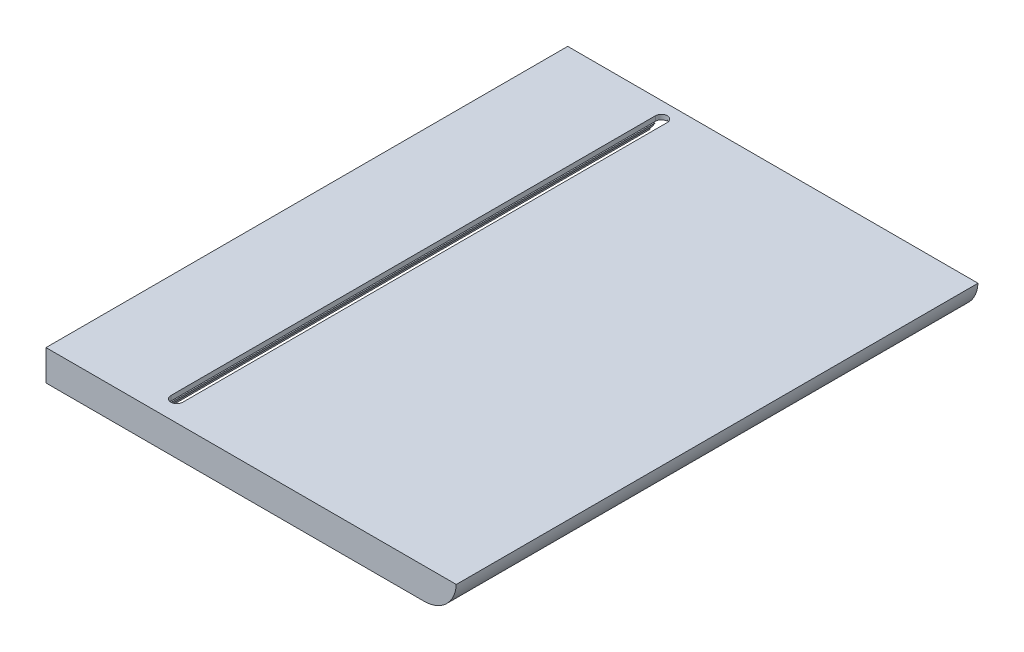
ISO-10303-21;
HEADER;
FILE_DESCRIPTION(('STEP AP214'),'2;1');
FILE_NAME('part.step','',(''),(''),'','','');
FILE_SCHEMA(('AUTOMOTIVE_DESIGN { 1 0 10303 214 1 1 1 1 }'));
ENDSEC;
DATA;
#1=APPLICATION_CONTEXT('core data for automotive mechanical design processes');
#2=APPLICATION_PROTOCOL_DEFINITION('international standard','automotive_design',2000,#1);
#3=PRODUCT_CONTEXT('',#1,'mechanical');
#4=PRODUCT('Part','Part','',(#3));
#5=PRODUCT_RELATED_PRODUCT_CATEGORY('part','',(#4));
#6=PRODUCT_DEFINITION_FORMATION('','',#4);
#7=PRODUCT_DEFINITION_CONTEXT('part definition',#1,'design');
#8=PRODUCT_DEFINITION('design','',#6,#7);
#9=PRODUCT_DEFINITION_SHAPE('','',#8);
#10=(LENGTH_UNIT() NAMED_UNIT(*) SI_UNIT(.MILLI.,.METRE.));
#11=(NAMED_UNIT(*) PLANE_ANGLE_UNIT() SI_UNIT($,.RADIAN.));
#12=(NAMED_UNIT(*) SI_UNIT($,.STERADIAN.) SOLID_ANGLE_UNIT());
#13=UNCERTAINTY_MEASURE_WITH_UNIT(LENGTH_MEASURE(1.E-05),#10,'distance_accuracy_value','');
#14=(GEOMETRIC_REPRESENTATION_CONTEXT(3) GLOBAL_UNCERTAINTY_ASSIGNED_CONTEXT((#13)) GLOBAL_UNIT_ASSIGNED_CONTEXT((#10,
#11,#12)) REPRESENTATION_CONTEXT('',''));
#15=CARTESIAN_POINT('',(0.,0.,0.));
#16=DIRECTION('',(0.,0.,1.));
#17=DIRECTION('',(1.,0.,0.));
#18=AXIS2_PLACEMENT_3D('',#15,#16,#17);
#19=CARTESIAN_POINT('',(66.7,-102.000000000001,100.67082039325));
#20=DIRECTION('',(-0.707106781186531,0.707106781186564,0.));
#21=DIRECTION('',(-0.707106781186564,-0.707106781186531,0.));
#22=AXIS2_PLACEMENT_3D('',#19,#20,#21);
#23=PLANE('',#22);
#24=DIRECTION('',(0.,0.,-1.));
#25=VECTOR('',#24,1.);
#26=CARTESIAN_POINT('',(67.,-101.700000000001,100.67082039325));
#27=LINE('',#26,#25);
#28=CARTESIAN_POINT('',(67.,-101.700000000001,-56.8249999999984));
#29=VERTEX_POINT('',#28);
#30=CARTESIAN_POINT('',(67.,-101.700000000001,-59.9999999999999));
#31=VERTEX_POINT('',#30);
#32=EDGE_CURVE('E382',#29,#31,#27,.T.);
#33=ORIENTED_EDGE('',*,*,#32,.F.);
#34=CARTESIAN_POINT('',(67.0000000000015,-101.699999999999,-55.));
#35=DIRECTION('',(-0.707106781186531,0.707106781186564,0.));
#36=DIRECTION('',(0.707106781186564,0.707106781186531,0.));
#37=AXIS2_PLACEMENT_3D('',#34,#35,#36);
#38=ELLIPSE('',#37,2.5809397513287,1.82499999999849);
#39=CARTESIAN_POINT('',(66.7,-102.000000000001,-56.8001736027376));
#40=VERTEX_POINT('',#39);
#41=EDGE_CURVE('E499',#29,#40,#38,.T.);
#42=ORIENTED_EDGE('',*,*,#41,.T.);
#43=DIRECTION('',(0.,0.,-1.));
#44=VECTOR('',#43,1.);
#45=CARTESIAN_POINT('',(66.7,-102.000000000001,100.67082039325));
#46=LINE('',#45,#44);
#47=CARTESIAN_POINT('',(66.7,-102.000000000001,-59.9999999999999));
#48=VERTEX_POINT('',#47);
#49=EDGE_CURVE('E391',#40,#48,#46,.T.);
#50=ORIENTED_EDGE('',*,*,#49,.T.);
#51=DIRECTION('',(0.707106781186564,0.707106781186531,0.));
#52=VECTOR('',#51,1.);
#53=CARTESIAN_POINT('',(84.3499999999989,-84.3500000000028,-60.));
#54=LINE('',#53,#52);
#55=EDGE_CURVE('E399',#48,#31,#54,.T.);
#56=ORIENTED_EDGE('',*,*,#55,.T.);
#57=EDGE_LOOP('',(#33,#42,#50,#56));
#58=FACE_BOUND('',#57,.T.);
#59=ADVANCED_FACE('F33',(#58),#23,.F.);
#60=CARTESIAN_POINT('',(67.,-101.700000000001,100.67082039325));
#61=DIRECTION('',(0.707106781186531,0.707106781186564,0.));
#62=DIRECTION('',(-0.707106781186564,0.707106781186531,0.));
#63=AXIS2_PLACEMENT_3D('',#60,#61,#62);
#64=PLANE('',#63);
#65=DIRECTION('',(0.,0.,-1.));
#66=VECTOR('',#65,1.);
#67=CARTESIAN_POINT('',(67.3,-102.000000000001,100.67082039325));
#68=LINE('',#67,#66);
#69=CARTESIAN_POINT('',(67.3,-102.000000000001,-56.8001736027381));
#70=VERTEX_POINT('',#69);
#71=CARTESIAN_POINT('',(67.2999999999991,-102.,-60.));
#72=VERTEX_POINT('',#71);
#73=EDGE_CURVE('E386',#70,#72,#68,.T.);
#74=ORIENTED_EDGE('',*,*,#73,.F.);
#75=CARTESIAN_POINT('',(67.0000000000015,-101.700000000002,-55.));
#76=DIRECTION('',(0.707106781186531,0.707106781186564,0.));
#77=DIRECTION('',(-0.707106781186564,0.707106781186531,0.));
#78=AXIS2_PLACEMENT_3D('',#75,#76,#77);
#79=ELLIPSE('',#78,2.58093975132872,1.82499999999849);
#80=EDGE_CURVE('E489',#70,#29,#79,.T.);
#81=ORIENTED_EDGE('',*,*,#80,.T.);
#82=ORIENTED_EDGE('',*,*,#32,.T.);
#83=DIRECTION('',(0.707106781186564,-0.707106781186531,0.));
#84=VECTOR('',#83,1.);
#85=CARTESIAN_POINT('',(-17.350000000002,-17.3500000000028,-60.));
#86=LINE('',#85,#84);
#87=EDGE_CURVE('E396',#31,#72,#86,.T.);
#88=ORIENTED_EDGE('',*,*,#87,.T.);
#89=EDGE_LOOP('',(#74,#81,#82,#88));
#90=FACE_BOUND('',#89,.T.);
#91=ADVANCED_FACE('F494',(#90),#64,.F.);
#92=CARTESIAN_POINT('',(34.5000000000001,-102.,80.));
#93=DIRECTION('',(0.,-1.,0.));
#94=DIRECTION('',(0.,0.,-1.));
#95=AXIS2_PLACEMENT_3D('',#92,#93,#94);
#96=PLANE('',#95);
#97=DIRECTION('',(0.,0.,-1.));
#98=VECTOR('',#97,1.);
#99=CARTESIAN_POINT('',(57.2500000000008,-102.,80.));
#100=LINE('',#99,#98);
#101=CARTESIAN_POINT('',(57.2500000000008,-102.,100.));
#102=VERTEX_POINT('',#101);
#103=CARTESIAN_POINT('',(57.2500000000008,-102.,-60.));
#104=VERTEX_POINT('',#103);
#105=EDGE_CURVE('E335',#102,#104,#100,.T.);
#106=ORIENTED_EDGE('',*,*,#105,.F.);
#107=DIRECTION('',(1.,0.,0.));
#108=VECTOR('',#107,1.);
#109=CARTESIAN_POINT('',(34.5000000000001,-102.,100.));
#110=LINE('',#109,#108);
#111=CARTESIAN_POINT('',(34.5000000000001,-102.,100.));
#112=VERTEX_POINT('',#111);
#113=EDGE_CURVE('E439',#112,#102,#110,.T.);
#114=ORIENTED_EDGE('',*,*,#113,.F.);
#115=DIRECTION('',(0.,0.,1.));
#116=VECTOR('',#115,1.);
#117=CARTESIAN_POINT('',(34.5000000000001,-102.,80.));
#118=LINE('',#117,#116);
#119=CARTESIAN_POINT('',(34.5000000000001,-102.,-60.));
#120=VERTEX_POINT('',#119);
#121=EDGE_CURVE('E447',#120,#112,#118,.T.);
#122=ORIENTED_EDGE('',*,*,#121,.F.);
#123=DIRECTION('',(1.,0.,0.));
#124=VECTOR('',#123,1.);
#125=CARTESIAN_POINT('',(34.5000000000001,-102.,-60.));
#126=LINE('',#125,#124);
#127=EDGE_CURVE('E423',#120,#104,#126,.T.);
#128=ORIENTED_EDGE('',*,*,#127,.T.);
#129=EDGE_LOOP('',(#106,#114,#122,#128));
#130=FACE_BOUND('',#129,.T.);
#131=ADVANCED_FACE('F604',(#130),#96,.T.);
#132=CARTESIAN_POINT('',(0.,0.,100.));
#133=DIRECTION('',(0.,0.,1.));
#134=DIRECTION('',(1.,0.,0.));
#135=AXIS2_PLACEMENT_3D('',#132,#133,#134);
#136=PLANE('',#135);
#137=ORIENTED_EDGE('',*,*,#113,.T.);
#138=DIRECTION('',(0.,-1.,0.));
#139=VECTOR('',#138,1.);
#140=CARTESIAN_POINT('',(57.2500000000009,-110.,100.));
#141=LINE('',#140,#139);
#142=CARTESIAN_POINT('',(57.2500000000009,-108.5,100.));
#143=VERTEX_POINT('',#142);
#144=EDGE_CURVE('E297',#102,#143,#141,.T.);
#145=ORIENTED_EDGE('',*,*,#144,.T.);
#146=DIRECTION('',(-1.,0.,0.));
#147=VECTOR('',#146,1.);
#148=CARTESIAN_POINT('',(150.012507822281,-108.5,100.));
#149=LINE('',#148,#147);
#150=CARTESIAN_POINT('',(34.5000000000001,-108.5,100.));
#151=VERTEX_POINT('',#150);
#152=EDGE_CURVE('E431',#143,#151,#149,.T.);
#153=ORIENTED_EDGE('',*,*,#152,.T.);
#154=DIRECTION('',(0.,1.,0.));
#155=VECTOR('',#154,1.);
#156=CARTESIAN_POINT('',(34.5000000000001,-108.5,100.));
#157=LINE('',#156,#155);
#158=EDGE_CURVE('E435',#151,#112,#157,.T.);
#159=ORIENTED_EDGE('',*,*,#158,.T.);
#160=EDGE_LOOP('',(#137,#145,#153,#159));
#161=FACE_BOUND('',#160,.T.);
#162=ADVANCED_FACE('F640',(#161),#136,.F.);
#163=DIRECTION('',(0.499999999999999,0.866025403784439,0.));
#164=VECTOR('',#163,1.);
#165=CARTESIAN_POINT('',(60.4330127018922,-106.800000000001,100.));
#166=LINE('',#165,#164);
#167=CARTESIAN_POINT('',(59.278312163513,-108.800000000001,100.));
#168=VERTEX_POINT('',#167);
#169=CARTESIAN_POINT('',(60.0000000000009,-107.55,100.));
#170=VERTEX_POINT('',#169);
#171=EDGE_CURVE('E350',#168,#170,#166,.T.);
#172=ORIENTED_EDGE('',*,*,#171,.T.);
#173=DIRECTION('',(-1.,0.,0.));
#174=VECTOR('',#173,1.);
#175=CARTESIAN_POINT('',(58.5000000000009,-107.55,100.));
#176=LINE('',#175,#174);
#177=CARTESIAN_POINT('',(58.5000000000009,-107.55,100.));
#178=VERTEX_POINT('',#177);
#179=EDGE_CURVE('E294',#170,#178,#176,.T.);
#180=ORIENTED_EDGE('',*,*,#179,.T.);
#181=DIRECTION('',(0.,1.,0.));
#182=VECTOR('',#181,1.);
#183=CARTESIAN_POINT('',(58.5000000000008,-102.,100.));
#184=LINE('',#183,#182);
#185=CARTESIAN_POINT('',(58.5000000000008,-102.,100.));
#186=VERTEX_POINT('',#185);
#187=EDGE_CURVE('E291',#178,#186,#184,.T.);
#188=ORIENTED_EDGE('',*,*,#187,.T.);
#189=CARTESIAN_POINT('',(66.7,-102.000000000001,100.));
#190=VERTEX_POINT('',#189);
#191=EDGE_CURVE('E443',#186,#190,#110,.T.);
#192=ORIENTED_EDGE('',*,*,#191,.T.);
#193=DIRECTION('',(0.707106781186564,0.707106781186531,0.));
#194=VECTOR('',#193,1.);
#195=CARTESIAN_POINT('',(66.7,-102.000000000001,100.));
#196=LINE('',#195,#194);
#197=CARTESIAN_POINT('',(67.,-101.700000000001,100.));
#198=VERTEX_POINT('',#197);
#199=EDGE_CURVE('E379',#190,#198,#196,.T.);
#200=ORIENTED_EDGE('',*,*,#199,.T.);
#201=DIRECTION('',(0.707106781186564,-0.707106781186531,0.));
#202=VECTOR('',#201,1.);
#203=CARTESIAN_POINT('',(67.,-101.700000000001,100.));
#204=LINE('',#203,#202);
#205=CARTESIAN_POINT('',(67.3,-102.000000000001,100.));
#206=VERTEX_POINT('',#205);
#207=EDGE_CURVE('E383',#198,#206,#204,.T.);
#208=ORIENTED_EDGE('',*,*,#207,.T.);
#209=CARTESIAN_POINT('',(75.5000000000009,-102.,100.));
#210=VERTEX_POINT('',#209);
#211=EDGE_CURVE('E444',#206,#210,#110,.T.);
#212=ORIENTED_EDGE('',*,*,#211,.T.);
#213=DIRECTION('',(0.,-1.,0.));
#214=VECTOR('',#213,1.);
#215=CARTESIAN_POINT('',(75.5000000000009,-107.549999999999,100.));
#216=LINE('',#215,#214);
#217=CARTESIAN_POINT('',(75.5000000000009,-107.549999999999,100.));
#218=VERTEX_POINT('',#217);
#219=EDGE_CURVE('E289',#210,#218,#216,.T.);
#220=ORIENTED_EDGE('',*,*,#219,.T.);
#221=DIRECTION('',(-1.,0.,0.));
#222=VECTOR('',#221,1.);
#223=CARTESIAN_POINT('',(74.0000000000009,-107.549999999999,100.));
#224=LINE('',#223,#222);
#225=CARTESIAN_POINT('',(74.0000000000009,-107.549999999999,100.));
#226=VERTEX_POINT('',#225);
#227=EDGE_CURVE('E285',#218,#226,#224,.T.);
#228=ORIENTED_EDGE('',*,*,#227,.T.);
#229=DIRECTION('',(0.5,-0.866025403784439,0.));
#230=VECTOR('',#229,1.);
#231=CARTESIAN_POINT('',(74.721687836487,-108.800000000001,100.));
#232=LINE('',#231,#230);
#233=CARTESIAN_POINT('',(74.721687836487,-108.800000000001,100.));
#234=VERTEX_POINT('',#233);
#235=EDGE_CURVE('E348',#226,#234,#232,.T.);
#236=ORIENTED_EDGE('',*,*,#235,.T.);
#237=DIRECTION('',(1.,0.,0.));
#238=VECTOR('',#237,1.);
#239=CARTESIAN_POINT('',(75.5,-108.800000000001,100.));
#240=LINE('',#239,#238);
#241=CARTESIAN_POINT('',(75.5,-108.800000000001,100.));
#242=VERTEX_POINT('',#241);
#243=EDGE_CURVE('E343',#234,#242,#240,.T.);
#244=ORIENTED_EDGE('',*,*,#243,.T.);
#245=DIRECTION('',(0.,-1.,0.));
#246=VECTOR('',#245,1.);
#247=CARTESIAN_POINT('',(75.5,-108.800000000001,100.));
#248=LINE('',#247,#246);
#249=CARTESIAN_POINT('',(75.5,-110.000000000001,100.));
#250=VERTEX_POINT('',#249);
#251=EDGE_CURVE('E339',#242,#250,#248,.T.);
#252=ORIENTED_EDGE('',*,*,#251,.T.);
#253=DIRECTION('',(-1.,0.,0.));
#254=VECTOR('',#253,1.);
#255=CARTESIAN_POINT('',(75.5,-110.000000000001,100.));
#256=LINE('',#255,#254);
#257=CARTESIAN_POINT('',(58.5,-110.000000000001,100.));
#258=VERTEX_POINT('',#257);
#259=EDGE_CURVE('E361',#250,#258,#256,.T.);
#260=ORIENTED_EDGE('',*,*,#259,.T.);
#261=DIRECTION('',(0.,1.,0.));
#262=VECTOR('',#261,1.);
#263=CARTESIAN_POINT('',(58.5,-108.800000000001,100.));
#264=LINE('',#263,#262);
#265=CARTESIAN_POINT('',(58.5,-108.800000000001,100.));
#266=VERTEX_POINT('',#265);
#267=EDGE_CURVE('E357',#258,#266,#264,.T.);
#268=ORIENTED_EDGE('',*,*,#267,.T.);
#269=DIRECTION('',(1.,0.,0.));
#270=VECTOR('',#269,1.);
#271=CARTESIAN_POINT('',(59.278312163513,-108.800000000001,100.));
#272=LINE('',#271,#270);
#273=EDGE_CURVE('E353',#266,#168,#272,.T.);
#274=ORIENTED_EDGE('',*,*,#273,.T.);
#275=EDGE_LOOP('',(#172,#180,#188,#192,#200,#208,#212,#220,#228,#236,#244,#252,#260,#268,#274));
#276=FACE_BOUND('',#275,.T.);
#277=ADVANCED_FACE('F532',(#276),#136,.F.);
#278=CARTESIAN_POINT('',(67.0000000000015,-102.,-55.));
#279=DIRECTION('',(0.,-1.,0.));
#280=DIRECTION('',(0.,0.,-1.));
#281=AXIS2_PLACEMENT_3D('',#278,#279,#280);
#282=CIRCLE('',#281,1.82499999999849);
#283=CARTESIAN_POINT('',(68.8249999999985,-102.,-55.));
#284=VERTEX_POINT('',#283);
#285=EDGE_CURVE('E279',#70,#284,#282,.T.);
#286=ORIENTED_EDGE('',*,*,#285,.F.);
#287=ORIENTED_EDGE('',*,*,#73,.T.);
#288=CARTESIAN_POINT('',(75.5000000000009,-102.,-60.));
#289=VERTEX_POINT('',#288);
#290=EDGE_CURVE('E428',#72,#289,#126,.T.);
#291=ORIENTED_EDGE('',*,*,#290,.T.);
#292=DIRECTION('',(0.,0.,-1.));
#293=VECTOR('',#292,1.);
#294=CARTESIAN_POINT('',(75.5000000000008,-101.999999999999,121.691011963485));
#295=LINE('',#294,#293);
#296=EDGE_CURVE('E326',#210,#289,#295,.T.);
#297=ORIENTED_EDGE('',*,*,#296,.F.);
#298=ORIENTED_EDGE('',*,*,#211,.F.);
#299=CARTESIAN_POINT('',(67.3,-102.000000000001,96.8001736027483));
#300=VERTEX_POINT('',#299);
#301=EDGE_CURVE('E388',#206,#300,#68,.T.);
#302=ORIENTED_EDGE('',*,*,#301,.T.);
#303=CARTESIAN_POINT('',(67.0000000000015,-102.,95.));
#304=DIRECTION('',(0.,-1.,0.));
#305=DIRECTION('',(0.,0.,-1.));
#306=AXIS2_PLACEMENT_3D('',#303,#304,#305);
#307=CIRCLE('',#306,1.82500000000843);
#308=CARTESIAN_POINT('',(68.82500000001,-102.,94.9999999999967));
#309=VERTEX_POINT('',#308);
#310=EDGE_CURVE('E56',#309,#300,#307,.T.);
#311=ORIENTED_EDGE('',*,*,#310,.F.);
#312=DIRECTION('',(1.32486614271938E-13,0.,1.));
#313=VECTOR('',#312,1.);
#314=CARTESIAN_POINT('',(68.8250000000164,-102.,79.9999999999955));
#315=LINE('',#314,#313);
#316=EDGE_CURVE('E274',#284,#309,#315,.T.);
#317=ORIENTED_EDGE('',*,*,#316,.F.);
#318=EDGE_LOOP('',(#286,#287,#291,#297,#298,#302,#311,#317));
#319=FACE_BOUND('',#318,.T.);
#320=ADVANCED_FACE('F540',(#319),#96,.T.);
#321=CARTESIAN_POINT('',(150.012507822281,-108.5,80.));
#322=DIRECTION('',(0.,1.,0.));
#323=DIRECTION('',(-1.,0.,0.));
#324=AXIS2_PLACEMENT_3D('',#321,#322,#323);
#325=PLANE('',#324);
#326=DIRECTION('',(0.,0.,1.));
#327=VECTOR('',#326,1.);
#328=CARTESIAN_POINT('',(57.2500000000009,-108.5,80.));
#329=LINE('',#328,#327);
#330=CARTESIAN_POINT('',(57.2500000000009,-108.5,-60.));
#331=VERTEX_POINT('',#330);
#332=EDGE_CURVE('E337',#331,#143,#329,.T.);
#333=ORIENTED_EDGE('',*,*,#332,.F.);
#334=DIRECTION('',(-1.,0.,0.));
#335=VECTOR('',#334,1.);
#336=CARTESIAN_POINT('',(150.012507822281,-108.5,-60.));
#337=LINE('',#336,#335);
#338=CARTESIAN_POINT('',(34.5000000000001,-108.5,-60.));
#339=VERTEX_POINT('',#338);
#340=EDGE_CURVE('E405',#331,#339,#337,.T.);
#341=ORIENTED_EDGE('',*,*,#340,.T.);
#342=DIRECTION('',(0.,0.,1.));
#343=VECTOR('',#342,1.);
#344=CARTESIAN_POINT('',(34.5000000000001,-108.5,80.));
#345=LINE('',#344,#343);
#346=EDGE_CURVE('E449',#339,#151,#345,.T.);
#347=ORIENTED_EDGE('',*,*,#346,.T.);
#348=ORIENTED_EDGE('',*,*,#152,.F.);
#349=EDGE_LOOP('',(#333,#341,#347,#348));
#350=FACE_BOUND('',#349,.T.);
#351=ADVANCED_FACE('F613',(#350),#325,.T.);
#352=CARTESIAN_POINT('',(67.0000000000015,-102.,-55.));
#353=DIRECTION('',(0.,-1.,0.));
#354=DIRECTION('',(0.,0.,-1.));
#355=AXIS2_PLACEMENT_3D('',#352,#353,#354);
#356=CIRCLE('',#355,1.82499999999849);
#357=CARTESIAN_POINT('',(65.1750000000015,-102.,-55.));
#358=VERTEX_POINT('',#357);
#359=EDGE_CURVE('E273',#358,#40,#356,.T.);
#360=ORIENTED_EDGE('',*,*,#359,.F.);
#361=DIRECTION('',(0.,0.,-1.));
#362=VECTOR('',#361,1.);
#363=CARTESIAN_POINT('',(65.1750000000015,-102.,80.));
#364=LINE('',#363,#362);
#365=CARTESIAN_POINT('',(65.1750000000015,-102.,95.));
#366=VERTEX_POINT('',#365);
#367=EDGE_CURVE('E266',#366,#358,#364,.T.);
#368=ORIENTED_EDGE('',*,*,#367,.F.);
#369=CARTESIAN_POINT('',(67.0000000000015,-102.,95.));
#370=DIRECTION('',(0.,-1.,0.));
#371=DIRECTION('',(0.,0.,-1.));
#372=AXIS2_PLACEMENT_3D('',#369,#370,#371);
#373=CIRCLE('',#372,1.82500000000843);
#374=CARTESIAN_POINT('',(66.7,-102.000000000001,96.8001736027478));
#375=VERTEX_POINT('',#374);
#376=EDGE_CURVE('E253',#375,#366,#373,.T.);
#377=ORIENTED_EDGE('',*,*,#376,.F.);
#378=EDGE_CURVE('E394',#190,#375,#46,.T.);
#379=ORIENTED_EDGE('',*,*,#378,.F.);
#380=ORIENTED_EDGE('',*,*,#191,.F.);
#381=DIRECTION('',(0.,0.,-1.));
#382=VECTOR('',#381,1.);
#383=CARTESIAN_POINT('',(58.5000000000008,-102.,121.691011963485));
#384=LINE('',#383,#382);
#385=CARTESIAN_POINT('',(58.5000000000008,-102.,-60.));
#386=VERTEX_POINT('',#385);
#387=EDGE_CURVE('E323',#186,#386,#384,.T.);
#388=ORIENTED_EDGE('',*,*,#387,.T.);
#389=EDGE_CURVE('E427',#386,#48,#126,.T.);
#390=ORIENTED_EDGE('',*,*,#389,.T.);
#391=ORIENTED_EDGE('',*,*,#49,.F.);
#392=EDGE_LOOP('',(#360,#368,#377,#379,#380,#388,#390,#391));
#393=FACE_BOUND('',#392,.T.);
#394=ADVANCED_FACE('F271',(#393),#96,.T.);
#395=CARTESIAN_POINT('',(160.,-100.5,101.5));
#396=DIRECTION('',(0.,1.,0.));
#397=DIRECTION('',(-1.,0.,0.));
#398=AXIS2_PLACEMENT_3D('',#395,#396,#397);
#399=PLANE('',#398);
#400=CARTESIAN_POINT('',(67.0000000000015,-100.5,-55.));
#401=DIRECTION('',(0.,1.,0.));
#402=DIRECTION('',(-1.,0.,0.));
#403=AXIS2_PLACEMENT_3D('',#400,#401,#402);
#404=CIRCLE('',#403,1.82499999999849);
#405=CARTESIAN_POINT('',(68.8249999999985,-100.5,-55.));
#406=VERTEX_POINT('',#405);
#407=CARTESIAN_POINT('',(65.1750000000015,-100.5,-55.));
#408=VERTEX_POINT('',#407);
#409=EDGE_CURVE('E275',#406,#408,#404,.T.);
#410=ORIENTED_EDGE('',*,*,#409,.F.);
#411=DIRECTION('',(-1.32486614271938E-13,0.,-1.));
#412=VECTOR('',#411,1.);
#413=CARTESIAN_POINT('',(68.8250000000192,-100.5,101.500000000012));
#414=LINE('',#413,#412);
#415=CARTESIAN_POINT('',(68.82500000001,-100.5,94.9999999999967));
#416=VERTEX_POINT('',#415);
#417=EDGE_CURVE('E11',#416,#406,#414,.T.);
#418=ORIENTED_EDGE('',*,*,#417,.F.);
#419=CARTESIAN_POINT('',(67.0000000000015,-100.5,95.));
#420=DIRECTION('',(0.,1.,0.));
#421=DIRECTION('',(-1.,0.,0.));
#422=AXIS2_PLACEMENT_3D('',#419,#420,#421);
#423=CIRCLE('',#422,1.82500000000843);
#424=CARTESIAN_POINT('',(65.1750000000015,-100.5,95.));
#425=VERTEX_POINT('',#424);
#426=EDGE_CURVE('E953',#425,#416,#423,.T.);
#427=ORIENTED_EDGE('',*,*,#426,.F.);
#428=DIRECTION('',(0.,0.,1.));
#429=VECTOR('',#428,1.);
#430=CARTESIAN_POINT('',(65.1750000000015,-100.5,101.5));
#431=LINE('',#430,#429);
#432=EDGE_CURVE('E41',#408,#425,#431,.T.);
#433=ORIENTED_EDGE('',*,*,#432,.F.);
#434=EDGE_LOOP('',(#410,#418,#427,#433));
#435=FACE_BOUND('',#434,.T.);
#436=DIRECTION('',(0.,0.,-1.));
#437=VECTOR('',#436,1.);
#438=CARTESIAN_POINT('',(160.,-100.5,101.5));
#439=LINE('',#438,#437);
#440=CARTESIAN_POINT('',(160.,-100.5,101.5));
#441=VERTEX_POINT('',#440);
#442=CARTESIAN_POINT('',(160.,-100.5,-60.));
#443=VERTEX_POINT('',#442);
#444=EDGE_CURVE('E464',#441,#443,#439,.T.);
#445=ORIENTED_EDGE('',*,*,#444,.T.);
#446=DIRECTION('',(1.,0.,0.));
#447=VECTOR('',#446,1.);
#448=CARTESIAN_POINT('',(33.0000000000001,-100.5,-60.));
#449=LINE('',#448,#447);
#450=CARTESIAN_POINT('',(33.0000000000001,-100.5,-60.));
#451=VERTEX_POINT('',#450);
#452=EDGE_CURVE('E411',#451,#443,#449,.T.);
#453=ORIENTED_EDGE('',*,*,#452,.F.);
#454=DIRECTION('',(0.,0.,-1.));
#455=VECTOR('',#454,1.);
#456=CARTESIAN_POINT('',(33.0000000000001,-100.5,101.5));
#457=LINE('',#456,#455);
#458=CARTESIAN_POINT('',(33.0000000000001,-100.5,101.5));
#459=VERTEX_POINT('',#458);
#460=EDGE_CURVE('E468',#459,#451,#457,.T.);
#461=ORIENTED_EDGE('',*,*,#460,.F.);
#462=DIRECTION('',(1.,0.,0.));
#463=VECTOR('',#462,1.);
#464=CARTESIAN_POINT('',(160.,-100.5,101.5));
#465=LINE('',#464,#463);
#466=EDGE_CURVE('E460',#459,#441,#465,.T.);
#467=ORIENTED_EDGE('',*,*,#466,.T.);
#468=EDGE_LOOP('',(#445,#453,#461,#467));
#469=FACE_BOUND('',#468,.T.);
#470=ADVANCED_FACE('F625',(#435,#469),#399,.T.);
#471=CARTESIAN_POINT('',(33.0000000000001,-110.,101.5));
#472=DIRECTION('',(-1.,0.,0.));
#473=DIRECTION('',(0.,-1.,0.));
#474=AXIS2_PLACEMENT_3D('',#471,#472,#473);
#475=PLANE('',#474);
#476=ORIENTED_EDGE('',*,*,#460,.T.);
#477=DIRECTION('',(0.,1.,0.));
#478=VECTOR('',#477,1.);
#479=CARTESIAN_POINT('',(33.0000000000001,-110.,-60.));
#480=LINE('',#479,#478);
#481=CARTESIAN_POINT('',(33.0000000000001,-110.,-60.));
#482=VERTEX_POINT('',#481);
#483=EDGE_CURVE('E413',#482,#451,#480,.T.);
#484=ORIENTED_EDGE('',*,*,#483,.F.);
#485=DIRECTION('',(0.,0.,-1.));
#486=VECTOR('',#485,1.);
#487=CARTESIAN_POINT('',(33.0000000000001,-110.,101.5));
#488=LINE('',#487,#486);
#489=CARTESIAN_POINT('',(33.0000000000001,-110.,101.5));
#490=VERTEX_POINT('',#489);
#491=EDGE_CURVE('E463',#490,#482,#488,.T.);
#492=ORIENTED_EDGE('',*,*,#491,.F.);
#493=DIRECTION('',(0.,1.,0.));
#494=VECTOR('',#493,1.);
#495=CARTESIAN_POINT('',(33.0000000000001,-110.,101.5));
#496=LINE('',#495,#494);
#497=EDGE_CURVE('E457',#490,#459,#496,.T.);
#498=ORIENTED_EDGE('',*,*,#497,.T.);
#499=EDGE_LOOP('',(#476,#484,#492,#498));
#500=FACE_BOUND('',#499,.T.);
#501=ADVANCED_FACE('F699',(#500),#475,.T.);
#502=CARTESIAN_POINT('',(160.,-110.,101.5));
#503=DIRECTION('',(0.,-1.,0.));
#504=DIRECTION('',(1.,0.,0.));
#505=AXIS2_PLACEMENT_3D('',#502,#503,#504);
#506=PLANE('',#505);
#507=ORIENTED_EDGE('',*,*,#491,.T.);
#508=DIRECTION('',(-1.,0.,0.));
#509=VECTOR('',#508,1.);
#510=CARTESIAN_POINT('',(150.012507822281,-110.,-60.));
#511=LINE('',#510,#509);
#512=CARTESIAN_POINT('',(58.5,-110.000000000001,-60.));
#513=VERTEX_POINT('',#512);
#514=EDGE_CURVE('E416',#513,#482,#511,.T.);
#515=ORIENTED_EDGE('',*,*,#514,.F.);
#516=DIRECTION('',(0.,0.,-1.));
#517=VECTOR('',#516,1.);
#518=CARTESIAN_POINT('',(58.5,-110.000000000001,117.298554852935));
#519=LINE('',#518,#517);
#520=EDGE_CURVE('E360',#258,#513,#519,.T.);
#521=ORIENTED_EDGE('',*,*,#520,.F.);
#522=ORIENTED_EDGE('',*,*,#259,.F.);
#523=DIRECTION('',(0.,0.,-1.));
#524=VECTOR('',#523,1.);
#525=CARTESIAN_POINT('',(75.5,-110.000000000001,117.298554852935));
#526=LINE('',#525,#524);
#527=CARTESIAN_POINT('',(75.5,-110.000000000001,-60.));
#528=VERTEX_POINT('',#527);
#529=EDGE_CURVE('E342',#250,#528,#526,.T.);
#530=ORIENTED_EDGE('',*,*,#529,.T.);
#531=CARTESIAN_POINT('',(150.012507822281,-110.,-60.));
#532=VERTEX_POINT('',#531);
#533=EDGE_CURVE('E417',#532,#528,#511,.T.);
#534=ORIENTED_EDGE('',*,*,#533,.F.);
#535=DIRECTION('',(0.,0.,-1.));
#536=VECTOR('',#535,1.);
#537=CARTESIAN_POINT('',(150.012507822281,-110.,101.5));
#538=LINE('',#537,#536);
#539=CARTESIAN_POINT('',(150.012507822281,-110.,101.5));
#540=VERTEX_POINT('',#539);
#541=EDGE_CURVE('E467',#532,#540,#538,.F.);
#542=ORIENTED_EDGE('',*,*,#541,.T.);
#543=DIRECTION('',(-1.,0.,0.));
#544=VECTOR('',#543,1.);
#545=CARTESIAN_POINT('',(160.,-110.,101.5));
#546=LINE('',#545,#544);
#547=EDGE_CURVE('E455',#540,#490,#546,.T.);
#548=ORIENTED_EDGE('',*,*,#547,.T.);
#549=EDGE_LOOP('',(#507,#515,#521,#522,#530,#534,#542,#548));
#550=FACE_BOUND('',#549,.T.);
#551=ADVANCED_FACE('F563',(#550),#506,.T.);
#552=CARTESIAN_POINT('',(0.,0.,101.5));
#553=DIRECTION('',(0.,0.,1.));
#554=DIRECTION('',(1.,0.,0.));
#555=AXIS2_PLACEMENT_3D('',#552,#553,#554);
#556=PLANE('',#555);
#557=ORIENTED_EDGE('',*,*,#547,.F.);
#558=CARTESIAN_POINT('',(150.012507822281,-100.,101.5));
#559=DIRECTION('',(0.,0.,1.));
#560=DIRECTION('',(1.,0.,0.));
#561=AXIS2_PLACEMENT_3D('',#558,#559,#560);
#562=CIRCLE('',#561,10.);
#563=EDGE_CURVE('E473',#540,#441,#562,.T.);
#564=ORIENTED_EDGE('',*,*,#563,.T.);
#565=ORIENTED_EDGE('',*,*,#466,.F.);
#566=ORIENTED_EDGE('',*,*,#497,.F.);
#567=EDGE_LOOP('',(#557,#564,#565,#566));
#568=FACE_BOUND('',#567,.T.);
#569=ADVANCED_FACE('F730',(#568),#556,.T.);
#570=CARTESIAN_POINT('',(150.012507822281,-100.,101.5));
#571=DIRECTION('',(0.,0.,1.));
#572=DIRECTION('',(1.,0.,0.));
#573=AXIS2_PLACEMENT_3D('',#570,#571,#572);
#574=CYLINDRICAL_SURFACE('',#573,10.);
#575=ORIENTED_EDGE('',*,*,#563,.F.);
#576=ORIENTED_EDGE('',*,*,#541,.F.);
#577=CARTESIAN_POINT('',(150.012507822281,-100.,-60.));
#578=DIRECTION('',(0.,0.,-1.));
#579=DIRECTION('',(-1.,0.,0.));
#580=AXIS2_PLACEMENT_3D('',#577,#578,#579);
#581=CIRCLE('',#580,10.);
#582=EDGE_CURVE('E419',#443,#532,#581,.T.);
#583=ORIENTED_EDGE('',*,*,#582,.F.);
#584=ORIENTED_EDGE('',*,*,#444,.F.);
#585=EDGE_LOOP('',(#575,#576,#583,#584));
#586=FACE_BOUND('',#585,.T.);
#587=ADVANCED_FACE('F35',(#586),#574,.T.);
#588=CARTESIAN_POINT('',(0.,0.,-60.));
#589=DIRECTION('',(0.,0.,-1.));
#590=DIRECTION('',(-1.,0.,0.));
#591=AXIS2_PLACEMENT_3D('',#588,#589,#590);
#592=PLANE('',#591);
#593=ORIENTED_EDGE('',*,*,#340,.F.);
#594=DIRECTION('',(0.,1.,0.));
#595=VECTOR('',#594,1.);
#596=CARTESIAN_POINT('',(57.2500000000009,-110.,-60.));
#597=LINE('',#596,#595);
#598=EDGE_CURVE('E277',#331,#104,#597,.T.);
#599=ORIENTED_EDGE('',*,*,#598,.T.);
#600=ORIENTED_EDGE('',*,*,#127,.F.);
#601=DIRECTION('',(0.,1.,0.));
#602=VECTOR('',#601,1.);
#603=CARTESIAN_POINT('',(34.5000000000001,-108.5,-60.));
#604=LINE('',#603,#602);
#605=EDGE_CURVE('E402',#339,#120,#604,.T.);
#606=ORIENTED_EDGE('',*,*,#605,.F.);
#607=EDGE_LOOP('',(#593,#599,#600,#606));
#608=FACE_BOUND('',#607,.T.);
#609=CARTESIAN_POINT('',(76.7500000000009,-102.,-60.));
#610=VERTEX_POINT('',#609);
#611=CARTESIAN_POINT('',(158.27386364321,-102.,-60.));
#612=VERTEX_POINT('',#611);
#613=EDGE_CURVE('E422',#610,#612,#126,.T.);
#614=ORIENTED_EDGE('',*,*,#613,.F.);
#615=DIRECTION('',(0.,-1.,0.));
#616=VECTOR('',#615,1.);
#617=CARTESIAN_POINT('',(76.7500000000008,-100.499999999999,-60.));
#618=LINE('',#617,#616);
#619=CARTESIAN_POINT('',(76.7500000000009,-108.5,-60.));
#620=VERTEX_POINT('',#619);
#621=EDGE_CURVE('E303',#610,#620,#618,.T.);
#622=ORIENTED_EDGE('',*,*,#621,.T.);
#623=CARTESIAN_POINT('',(150.012507822281,-108.5,-60.));
#624=VERTEX_POINT('',#623);
#625=EDGE_CURVE('E406',#624,#620,#337,.T.);
#626=ORIENTED_EDGE('',*,*,#625,.F.);
#627=CARTESIAN_POINT('',(150.012507822281,-100.,-60.));
#628=DIRECTION('',(0.,0.,-1.));
#629=DIRECTION('',(-1.,0.,0.));
#630=AXIS2_PLACEMENT_3D('',#627,#628,#629);
#631=CIRCLE('',#630,8.5);
#632=EDGE_CURVE('E408',#612,#624,#631,.T.);
#633=ORIENTED_EDGE('',*,*,#632,.F.);
#634=EDGE_LOOP('',(#614,#622,#626,#633));
#635=FACE_BOUND('',#634,.T.);
#636=ORIENTED_EDGE('',*,*,#452,.T.);
#637=ORIENTED_EDGE('',*,*,#582,.T.);
#638=ORIENTED_EDGE('',*,*,#533,.T.);
#639=DIRECTION('',(0.,-1.,0.));
#640=VECTOR('',#639,1.);
#641=CARTESIAN_POINT('',(75.5,0.,-60.));
#642=LINE('',#641,#640);
#643=CARTESIAN_POINT('',(75.5,-108.800000000001,-60.));
#644=VERTEX_POINT('',#643);
#645=EDGE_CURVE('E477',#644,#528,#642,.T.);
#646=ORIENTED_EDGE('',*,*,#645,.F.);
#647=DIRECTION('',(1.,0.,0.));
#648=VECTOR('',#647,1.);
#649=CARTESIAN_POINT('',(0.,-108.800000000001,-60.));
#650=LINE('',#649,#648);
#651=CARTESIAN_POINT('',(74.721687836487,-108.800000000001,-60.));
#652=VERTEX_POINT('',#651);
#653=EDGE_CURVE('E475',#652,#644,#650,.T.);
#654=ORIENTED_EDGE('',*,*,#653,.F.);
#655=DIRECTION('',(0.5,-0.866025403784439,0.));
#656=VECTOR('',#655,1.);
#657=CARTESIAN_POINT('',(8.92948391149144,5.15543994002401,-60.));
#658=LINE('',#657,#656);
#659=CARTESIAN_POINT('',(74.0000000000009,-107.549999999999,-60.));
#660=VERTEX_POINT('',#659);
#661=EDGE_CURVE('E375',#660,#652,#658,.T.);
#662=ORIENTED_EDGE('',*,*,#661,.F.);
#663=DIRECTION('',(1.,0.,0.));
#664=VECTOR('',#663,1.);
#665=CARTESIAN_POINT('',(74.0000000000009,-107.549999999999,-60.));
#666=LINE('',#665,#664);
#667=CARTESIAN_POINT('',(75.5000000000009,-107.549999999999,-60.));
#668=VERTEX_POINT('',#667);
#669=EDGE_CURVE('E306',#660,#668,#666,.T.);
#670=ORIENTED_EDGE('',*,*,#669,.T.);
#671=DIRECTION('',(0.,1.,0.));
#672=VECTOR('',#671,1.);
#673=CARTESIAN_POINT('',(75.5000000000009,-107.549999999999,-60.));
#674=LINE('',#673,#672);
#675=EDGE_CURVE('E309',#668,#289,#674,.T.);
#676=ORIENTED_EDGE('',*,*,#675,.T.);
#677=ORIENTED_EDGE('',*,*,#290,.F.);
#678=ORIENTED_EDGE('',*,*,#87,.F.);
#679=ORIENTED_EDGE('',*,*,#55,.F.);
#680=ORIENTED_EDGE('',*,*,#389,.F.);
#681=DIRECTION('',(0.,-1.,0.));
#682=VECTOR('',#681,1.);
#683=CARTESIAN_POINT('',(58.5000000000008,-102.,-60.));
#684=LINE('',#683,#682);
#685=CARTESIAN_POINT('',(58.5000000000009,-107.55,-60.));
#686=VERTEX_POINT('',#685);
#687=EDGE_CURVE('E312',#386,#686,#684,.T.);
#688=ORIENTED_EDGE('',*,*,#687,.T.);
#689=DIRECTION('',(1.,0.,0.));
#690=VECTOR('',#689,1.);
#691=CARTESIAN_POINT('',(58.5000000000009,-107.55,-60.));
#692=LINE('',#691,#690);
#693=CARTESIAN_POINT('',(60.0000000000009,-107.55,-60.));
#694=VERTEX_POINT('',#693);
#695=EDGE_CURVE('E315',#686,#694,#692,.T.);
#696=ORIENTED_EDGE('',*,*,#695,.T.);
#697=DIRECTION('',(0.499999999999999,0.866025403784439,0.));
#698=VECTOR('',#697,1.);
#699=CARTESIAN_POINT('',(91.5705160885086,-52.8682621135333,-60.));
#700=LINE('',#699,#698);
#701=CARTESIAN_POINT('',(59.278312163513,-108.800000000001,-60.));
#702=VERTEX_POINT('',#701);
#703=EDGE_CURVE('E377',#702,#694,#700,.T.);
#704=ORIENTED_EDGE('',*,*,#703,.F.);
#705=DIRECTION('',(1.,0.,0.));
#706=VECTOR('',#705,1.);
#707=CARTESIAN_POINT('',(-3.87994273833557E-12,-108.799999999999,-60.));
#708=LINE('',#707,#706);
#709=CARTESIAN_POINT('',(58.5,-108.800000000001,-60.));
#710=VERTEX_POINT('',#709);
#711=EDGE_CURVE('E480',#710,#702,#708,.T.);
#712=ORIENTED_EDGE('',*,*,#711,.F.);
#713=DIRECTION('',(0.,1.,0.));
#714=VECTOR('',#713,1.);
#715=CARTESIAN_POINT('',(58.5,0.,-60.));
#716=LINE('',#715,#714);
#717=EDGE_CURVE('E482',#513,#710,#716,.T.);
#718=ORIENTED_EDGE('',*,*,#717,.F.);
#719=ORIENTED_EDGE('',*,*,#514,.T.);
#720=ORIENTED_EDGE('',*,*,#483,.T.);
#721=EDGE_LOOP('',(#636,#637,#638,#646,#654,#662,#670,#676,#677,#678,#679,#680,#688,#696,#704,
#712,#718,#719,#720));
#722=FACE_BOUND('',#721,.T.);
#723=ADVANCED_FACE('F506',(#608,#635,#722),#592,.T.);
#724=CARTESIAN_POINT('',(150.012507822281,-108.5,100.));
#725=VERTEX_POINT('',#724);
#726=CARTESIAN_POINT('',(76.7500000000009,-108.5,100.));
#727=VERTEX_POINT('',#726);
#728=EDGE_CURVE('E432',#725,#727,#149,.T.);
#729=ORIENTED_EDGE('',*,*,#728,.T.);
#730=DIRECTION('',(0.,1.,0.));
#731=VECTOR('',#730,1.);
#732=CARTESIAN_POINT('',(76.7500000000008,-100.499999999999,100.));
#733=LINE('',#732,#731);
#734=CARTESIAN_POINT('',(76.7500000000009,-102.,100.));
#735=VERTEX_POINT('',#734);
#736=EDGE_CURVE('E283',#727,#735,#733,.T.);
#737=ORIENTED_EDGE('',*,*,#736,.T.);
#738=CARTESIAN_POINT('',(158.27386364321,-102.,100.));
#739=VERTEX_POINT('',#738);
#740=EDGE_CURVE('E438',#735,#739,#110,.T.);
#741=ORIENTED_EDGE('',*,*,#740,.T.);
#742=CARTESIAN_POINT('',(150.012507822281,-100.,100.));
#743=DIRECTION('',(0.,0.,-1.));
#744=DIRECTION('',(-1.,0.,0.));
#745=AXIS2_PLACEMENT_3D('',#742,#743,#744);
#746=CIRCLE('',#745,8.5);
#747=EDGE_CURVE('E426',#739,#725,#746,.T.);
#748=ORIENTED_EDGE('',*,*,#747,.T.);
#749=EDGE_LOOP('',(#729,#737,#741,#748));
#750=FACE_BOUND('',#749,.T.);
#751=ADVANCED_FACE('F527',(#750),#136,.F.);
#752=CARTESIAN_POINT('',(34.5000000000001,-108.5,80.));
#753=DIRECTION('',(1.,0.,0.));
#754=DIRECTION('',(0.,1.,0.));
#755=AXIS2_PLACEMENT_3D('',#752,#753,#754);
#756=PLANE('',#755);
#757=ORIENTED_EDGE('',*,*,#158,.F.);
#758=ORIENTED_EDGE('',*,*,#346,.F.);
#759=ORIENTED_EDGE('',*,*,#605,.T.);
#760=ORIENTED_EDGE('',*,*,#121,.T.);
#761=EDGE_LOOP('',(#757,#758,#759,#760));
#762=FACE_BOUND('',#761,.T.);
#763=ADVANCED_FACE('F637',(#762),#756,.T.);
#764=DIRECTION('',(0.,0.,1.));
#765=VECTOR('',#764,1.);
#766=CARTESIAN_POINT('',(76.7500000000008,-102.,80.));
#767=LINE('',#766,#765);
#768=EDGE_CURVE('E300',#610,#735,#767,.T.);
#769=ORIENTED_EDGE('',*,*,#768,.F.);
#770=ORIENTED_EDGE('',*,*,#613,.T.);
#771=DIRECTION('',(0.,0.,1.));
#772=VECTOR('',#771,1.);
#773=CARTESIAN_POINT('',(158.27386364321,-102.,80.));
#774=LINE('',#773,#772);
#775=EDGE_CURVE('E442',#612,#739,#774,.T.);
#776=ORIENTED_EDGE('',*,*,#775,.T.);
#777=ORIENTED_EDGE('',*,*,#740,.F.);
#778=EDGE_LOOP('',(#769,#770,#776,#777));
#779=FACE_BOUND('',#778,.T.);
#780=ADVANCED_FACE('F512',(#779),#96,.T.);
#781=CARTESIAN_POINT('',(150.012507822281,-100.,80.));
#782=DIRECTION('',(0.,0.,1.));
#783=DIRECTION('',(1.,0.,0.));
#784=AXIS2_PLACEMENT_3D('',#781,#782,#783);
#785=CYLINDRICAL_SURFACE('',#784,8.5);
#786=ORIENTED_EDGE('',*,*,#747,.F.);
#787=ORIENTED_EDGE('',*,*,#775,.F.);
#788=ORIENTED_EDGE('',*,*,#632,.T.);
#789=DIRECTION('',(0.,0.,1.));
#790=VECTOR('',#789,1.);
#791=CARTESIAN_POINT('',(150.012507822281,-108.5,80.));
#792=LINE('',#791,#790);
#793=EDGE_CURVE('E452',#624,#725,#792,.T.);
#794=ORIENTED_EDGE('',*,*,#793,.T.);
#795=EDGE_LOOP('',(#786,#787,#788,#794));
#796=FACE_BOUND('',#795,.T.);
#797=ADVANCED_FACE('F519',(#796),#785,.F.);
#798=DIRECTION('',(0.,0.,-1.));
#799=VECTOR('',#798,1.);
#800=CARTESIAN_POINT('',(76.7500000000009,-108.5,80.));
#801=LINE('',#800,#799);
#802=EDGE_CURVE('E484',#727,#620,#801,.T.);
#803=ORIENTED_EDGE('',*,*,#802,.F.);
#804=ORIENTED_EDGE('',*,*,#728,.F.);
#805=ORIENTED_EDGE('',*,*,#793,.F.);
#806=ORIENTED_EDGE('',*,*,#625,.T.);
#807=EDGE_LOOP('',(#803,#804,#805,#806));
#808=FACE_BOUND('',#807,.T.);
#809=ADVANCED_FACE('F522',(#808),#325,.T.);
#810=ORIENTED_EDGE('',*,*,#378,.T.);
#811=CARTESIAN_POINT('',(67.0000000000015,-101.699999999999,95.));
#812=DIRECTION('',(-0.707106781186531,0.707106781186564,0.));
#813=DIRECTION('',(0.707106781186564,0.707106781186531,0.));
#814=AXIS2_PLACEMENT_3D('',#811,#812,#813);
#815=ELLIPSE('',#814,2.58093975134275,1.82500000000843);
#816=CARTESIAN_POINT('',(67.,-101.700000000001,96.8250000000084));
#817=VERTEX_POINT('',#816);
#818=EDGE_CURVE('E259',#375,#817,#815,.T.);
#819=ORIENTED_EDGE('',*,*,#818,.T.);
#820=EDGE_CURVE('E387',#198,#817,#27,.T.);
#821=ORIENTED_EDGE('',*,*,#820,.F.);
#822=ORIENTED_EDGE('',*,*,#199,.F.);
#823=EDGE_LOOP('',(#810,#819,#821,#822));
#824=FACE_BOUND('',#823,.T.);
#825=ADVANCED_FACE('F535',(#824),#23,.F.);
#826=ORIENTED_EDGE('',*,*,#820,.T.);
#827=CARTESIAN_POINT('',(67.0000000000015,-101.700000000002,95.));
#828=DIRECTION('',(0.707106781186531,0.707106781186564,0.));
#829=DIRECTION('',(-0.707106781186564,0.707106781186531,0.));
#830=AXIS2_PLACEMENT_3D('',#827,#828,#829);
#831=ELLIPSE('',#830,2.58093975134277,1.82500000000843);
#832=EDGE_CURVE('E487',#817,#300,#831,.T.);
#833=ORIENTED_EDGE('',*,*,#832,.T.);
#834=ORIENTED_EDGE('',*,*,#301,.F.);
#835=ORIENTED_EDGE('',*,*,#207,.F.);
#836=EDGE_LOOP('',(#826,#833,#834,#835));
#837=FACE_BOUND('',#836,.T.);
#838=ADVANCED_FACE('F537',(#837),#64,.F.);
#839=CARTESIAN_POINT('',(75.5,-108.800000000001,117.298554852935));
#840=DIRECTION('',(1.,0.,0.));
#841=DIRECTION('',(0.,0.,-1.));
#842=AXIS2_PLACEMENT_3D('',#839,#840,#841);
#843=PLANE('',#842);
#844=ORIENTED_EDGE('',*,*,#645,.T.);
#845=ORIENTED_EDGE('',*,*,#529,.F.);
#846=ORIENTED_EDGE('',*,*,#251,.F.);
#847=DIRECTION('',(0.,0.,-1.));
#848=VECTOR('',#847,1.);
#849=CARTESIAN_POINT('',(75.5,-108.800000000001,117.298554852935));
#850=LINE('',#849,#848);
#851=EDGE_CURVE('E346',#242,#644,#850,.T.);
#852=ORIENTED_EDGE('',*,*,#851,.T.);
#853=EDGE_LOOP('',(#844,#845,#846,#852));
#854=FACE_BOUND('',#853,.T.);
#855=ADVANCED_FACE('F559',(#854),#843,.F.);
#856=CARTESIAN_POINT('',(58.5,-108.800000000001,117.298554852935));
#857=DIRECTION('',(-1.,0.,0.));
#858=DIRECTION('',(0.,0.,1.));
#859=AXIS2_PLACEMENT_3D('',#856,#857,#858);
#860=PLANE('',#859);
#861=ORIENTED_EDGE('',*,*,#717,.T.);
#862=DIRECTION('',(0.,0.,-1.));
#863=VECTOR('',#862,1.);
#864=CARTESIAN_POINT('',(58.5,-108.800000000001,117.298554852935));
#865=LINE('',#864,#863);
#866=EDGE_CURVE('E356',#266,#710,#865,.T.);
#867=ORIENTED_EDGE('',*,*,#866,.F.);
#868=ORIENTED_EDGE('',*,*,#267,.F.);
#869=ORIENTED_EDGE('',*,*,#520,.T.);
#870=EDGE_LOOP('',(#861,#867,#868,#869));
#871=FACE_BOUND('',#870,.T.);
#872=ADVANCED_FACE('F570',(#871),#860,.F.);
#873=CARTESIAN_POINT('',(59.278312163513,-108.800000000001,117.298554852935));
#874=DIRECTION('',(0.,1.,0.));
#875=DIRECTION('',(-1.,0.,0.));
#876=AXIS2_PLACEMENT_3D('',#873,#874,#875);
#877=PLANE('',#876);
#878=ORIENTED_EDGE('',*,*,#711,.T.);
#879=DIRECTION('',(0.,0.,-1.));
#880=VECTOR('',#879,1.);
#881=CARTESIAN_POINT('',(59.278312163513,-108.800000000001,117.298554852935));
#882=LINE('',#881,#880);
#883=EDGE_CURVE('E352',#168,#702,#882,.T.);
#884=ORIENTED_EDGE('',*,*,#883,.F.);
#885=ORIENTED_EDGE('',*,*,#273,.F.);
#886=ORIENTED_EDGE('',*,*,#866,.T.);
#887=EDGE_LOOP('',(#878,#884,#885,#886));
#888=FACE_BOUND('',#887,.T.);
#889=ADVANCED_FACE('F576',(#888),#877,.F.);
#890=CARTESIAN_POINT('',(60.4330127018922,-106.800000000001,117.298554852935));
#891=DIRECTION('',(-0.866025403784439,0.499999999999999,0.));
#892=DIRECTION('',(-0.499999999999999,-0.866025403784439,0.));
#893=AXIS2_PLACEMENT_3D('',#890,#891,#892);
#894=PLANE('',#893);
#895=ORIENTED_EDGE('',*,*,#703,.T.);
#896=DIRECTION('',(0.,0.,-1.));
#897=VECTOR('',#896,1.);
#898=CARTESIAN_POINT('',(60.0000000000009,-107.55,121.691011963485));
#899=LINE('',#898,#897);
#900=EDGE_CURVE('E286',#170,#694,#899,.T.);
#901=ORIENTED_EDGE('',*,*,#900,.F.);
#902=ORIENTED_EDGE('',*,*,#171,.F.);
#903=ORIENTED_EDGE('',*,*,#883,.T.);
#904=EDGE_LOOP('',(#895,#901,#902,#903));
#905=FACE_BOUND('',#904,.T.);
#906=ADVANCED_FACE('F578',(#905),#894,.F.);
#907=CARTESIAN_POINT('',(74.721687836487,-108.800000000001,117.298554852935));
#908=DIRECTION('',(0.866025403784439,0.5,0.));
#909=DIRECTION('',(-0.5,0.866025403784439,0.));
#910=AXIS2_PLACEMENT_3D('',#907,#908,#909);
#911=PLANE('',#910);
#912=ORIENTED_EDGE('',*,*,#661,.T.);
#913=DIRECTION('',(0.,0.,-1.));
#914=VECTOR('',#913,1.);
#915=CARTESIAN_POINT('',(74.721687836487,-108.800000000001,117.298554852935));
#916=LINE('',#915,#914);
#917=EDGE_CURVE('E347',#234,#652,#916,.T.);
#918=ORIENTED_EDGE('',*,*,#917,.F.);
#919=ORIENTED_EDGE('',*,*,#235,.F.);
#920=DIRECTION('',(0.,0.,-1.));
#921=VECTOR('',#920,1.);
#922=CARTESIAN_POINT('',(74.0000000000009,-107.549999999999,121.691011963485));
#923=LINE('',#922,#921);
#924=EDGE_CURVE('E318',#226,#660,#923,.T.);
#925=ORIENTED_EDGE('',*,*,#924,.T.);
#926=EDGE_LOOP('',(#912,#918,#919,#925));
#927=FACE_BOUND('',#926,.T.);
#928=ADVANCED_FACE('F550',(#927),#911,.F.);
#929=CARTESIAN_POINT('',(75.5,-108.800000000001,117.298554852935));
#930=DIRECTION('',(0.,1.,0.));
#931=DIRECTION('',(0.,0.,1.));
#932=AXIS2_PLACEMENT_3D('',#929,#930,#931);
#933=PLANE('',#932);
#934=ORIENTED_EDGE('',*,*,#653,.T.);
#935=ORIENTED_EDGE('',*,*,#851,.F.);
#936=ORIENTED_EDGE('',*,*,#243,.F.);
#937=ORIENTED_EDGE('',*,*,#917,.T.);
#938=EDGE_LOOP('',(#934,#935,#936,#937));
#939=FACE_BOUND('',#938,.T.);
#940=ADVANCED_FACE('F555',(#939),#933,.F.);
#941=CARTESIAN_POINT('',(76.7500000000008,-100.499999999999,121.691011963485));
#942=DIRECTION('',(1.,0.,0.));
#943=DIRECTION('',(0.,1.,0.));
#944=AXIS2_PLACEMENT_3D('',#941,#942,#943);
#945=PLANE('',#944);
#946=ORIENTED_EDGE('',*,*,#621,.F.);
#947=ORIENTED_EDGE('',*,*,#768,.T.);
#948=ORIENTED_EDGE('',*,*,#736,.F.);
#949=ORIENTED_EDGE('',*,*,#802,.T.);
#950=EDGE_LOOP('',(#946,#947,#948,#949));
#951=FACE_BOUND('',#950,.T.);
#952=ADVANCED_FACE('F525',(#951),#945,.T.);
#953=CARTESIAN_POINT('',(75.5000000000009,-107.549999999999,121.691011963485));
#954=DIRECTION('',(-1.,0.,0.));
#955=DIRECTION('',(0.,-1.,0.));
#956=AXIS2_PLACEMENT_3D('',#953,#954,#955);
#957=PLANE('',#956);
#958=ORIENTED_EDGE('',*,*,#219,.F.);
#959=ORIENTED_EDGE('',*,*,#296,.T.);
#960=ORIENTED_EDGE('',*,*,#675,.F.);
#961=DIRECTION('',(0.,0.,-1.));
#962=VECTOR('',#961,1.);
#963=CARTESIAN_POINT('',(75.5000000000009,-107.549999999999,121.691011963485));
#964=LINE('',#963,#962);
#965=EDGE_CURVE('E329',#218,#668,#964,.T.);
#966=ORIENTED_EDGE('',*,*,#965,.F.);
#967=EDGE_LOOP('',(#958,#959,#960,#966));
#968=FACE_BOUND('',#967,.T.);
#969=ADVANCED_FACE('F542',(#968),#957,.T.);
#970=CARTESIAN_POINT('',(74.0000000000009,-107.549999999999,121.691011963485));
#971=DIRECTION('',(0.,1.,0.));
#972=DIRECTION('',(0.,0.,1.));
#973=AXIS2_PLACEMENT_3D('',#970,#971,#972);
#974=PLANE('',#973);
#975=ORIENTED_EDGE('',*,*,#227,.F.);
#976=ORIENTED_EDGE('',*,*,#965,.T.);
#977=ORIENTED_EDGE('',*,*,#669,.F.);
#978=ORIENTED_EDGE('',*,*,#924,.F.);
#979=EDGE_LOOP('',(#975,#976,#977,#978));
#980=FACE_BOUND('',#979,.T.);
#981=ADVANCED_FACE('F547',(#980),#974,.T.);
#982=CARTESIAN_POINT('',(57.2500000000009,-110.,121.691011963485));
#983=DIRECTION('',(-1.,0.,0.));
#984=DIRECTION('',(0.,-1.,0.));
#985=AXIS2_PLACEMENT_3D('',#982,#983,#984);
#986=PLANE('',#985);
#987=ORIENTED_EDGE('',*,*,#598,.F.);
#988=ORIENTED_EDGE('',*,*,#332,.T.);
#989=ORIENTED_EDGE('',*,*,#144,.F.);
#990=ORIENTED_EDGE('',*,*,#105,.T.);
#991=EDGE_LOOP('',(#987,#988,#989,#990));
#992=FACE_BOUND('',#991,.T.);
#993=ADVANCED_FACE('F596',(#992),#986,.T.);
#994=CARTESIAN_POINT('',(58.5000000000009,-107.55,121.691011963485));
#995=DIRECTION('',(0.,1.,0.));
#996=DIRECTION('',(-1.,0.,0.));
#997=AXIS2_PLACEMENT_3D('',#994,#995,#996);
#998=PLANE('',#997);
#999=ORIENTED_EDGE('',*,*,#179,.F.);
#1000=ORIENTED_EDGE('',*,*,#900,.T.);
#1001=ORIENTED_EDGE('',*,*,#695,.F.);
#1002=DIRECTION('',(0.,0.,-1.));
#1003=VECTOR('',#1002,1.);
#1004=CARTESIAN_POINT('',(58.5000000000009,-107.55,121.691011963485));
#1005=LINE('',#1004,#1003);
#1006=EDGE_CURVE('E321',#178,#686,#1005,.T.);
#1007=ORIENTED_EDGE('',*,*,#1006,.F.);
#1008=EDGE_LOOP('',(#999,#1000,#1001,#1007));
#1009=FACE_BOUND('',#1008,.T.);
#1010=ADVANCED_FACE('F583',(#1009),#998,.T.);
#1011=CARTESIAN_POINT('',(58.5000000000008,-102.,121.691011963485));
#1012=DIRECTION('',(1.,0.,0.));
#1013=DIRECTION('',(0.,1.,0.));
#1014=AXIS2_PLACEMENT_3D('',#1011,#1012,#1013);
#1015=PLANE('',#1014);
#1016=ORIENTED_EDGE('',*,*,#187,.F.);
#1017=ORIENTED_EDGE('',*,*,#1006,.T.);
#1018=ORIENTED_EDGE('',*,*,#687,.F.);
#1019=ORIENTED_EDGE('',*,*,#387,.F.);
#1020=EDGE_LOOP('',(#1016,#1017,#1018,#1019));
#1021=FACE_BOUND('',#1020,.T.);
#1022=ADVANCED_FACE('F586',(#1021),#1015,.T.);
#1023=CARTESIAN_POINT('',(67.0000000000015,-110.000000000001,-55.));
#1024=DIRECTION('',(0.,1.,0.));
#1025=DIRECTION('',(-1.,0.,0.));
#1026=AXIS2_PLACEMENT_3D('',#1023,#1024,#1025);
#1027=CYLINDRICAL_SURFACE('',#1026,1.82499999999849);
#1028=ORIENTED_EDGE('',*,*,#409,.T.);
#1029=DIRECTION('',(0.,1.,0.));
#1030=VECTOR('',#1029,1.);
#1031=CARTESIAN_POINT('',(65.1750000000015,-110.000000000001,-55.));
#1032=LINE('',#1031,#1030);
#1033=EDGE_CURVE('E48',#358,#408,#1032,.T.);
#1034=ORIENTED_EDGE('',*,*,#1033,.F.);
#1035=ORIENTED_EDGE('',*,*,#359,.T.);
#1036=ORIENTED_EDGE('',*,*,#41,.F.);
#1037=ORIENTED_EDGE('',*,*,#80,.F.);
#1038=ORIENTED_EDGE('',*,*,#285,.T.);
#1039=DIRECTION('',(0.,1.,0.));
#1040=VECTOR('',#1039,1.);
#1041=CARTESIAN_POINT('',(68.8249999999985,-110.000000000001,-55.));
#1042=LINE('',#1041,#1040);
#1043=EDGE_CURVE('E952',#284,#406,#1042,.T.);
#1044=ORIENTED_EDGE('',*,*,#1043,.T.);
#1045=EDGE_LOOP('',(#1028,#1034,#1035,#1036,#1037,#1038,#1044));
#1046=FACE_BOUND('',#1045,.T.);
#1047=ADVANCED_FACE('F588',(#1046),#1027,.F.);
#1048=CARTESIAN_POINT('',(68.8250000000184,-110.000000000001,94.9999999999967));
#1049=DIRECTION('',(1.,0.,-1.32486614271938E-13));
#1050=DIRECTION('',(-1.32486614271938E-13,0.,-1.));
#1051=AXIS2_PLACEMENT_3D('',#1048,#1049,#1050);
#1052=PLANE('',#1051);
#1053=ORIENTED_EDGE('',*,*,#316,.T.);
#1054=DIRECTION('',(0.,1.,0.));
#1055=VECTOR('',#1054,1.);
#1056=CARTESIAN_POINT('',(68.82500000001,-110.000000000001,94.9999999999967));
#1057=LINE('',#1056,#1055);
#1058=EDGE_CURVE('E268',#309,#416,#1057,.T.);
#1059=ORIENTED_EDGE('',*,*,#1058,.T.);
#1060=ORIENTED_EDGE('',*,*,#417,.T.);
#1061=ORIENTED_EDGE('',*,*,#1043,.F.);
#1062=EDGE_LOOP('',(#1053,#1059,#1060,#1061));
#1063=FACE_BOUND('',#1062,.T.);
#1064=ADVANCED_FACE('F594',(#1063),#1052,.F.);
#1065=CARTESIAN_POINT('',(67.0000000000015,-110.000000000001,95.));
#1066=DIRECTION('',(0.,1.,0.));
#1067=DIRECTION('',(-1.,0.,0.));
#1068=AXIS2_PLACEMENT_3D('',#1065,#1066,#1067);
#1069=CYLINDRICAL_SURFACE('',#1068,1.82500000000843);
#1070=ORIENTED_EDGE('',*,*,#426,.T.);
#1071=ORIENTED_EDGE('',*,*,#1058,.F.);
#1072=ORIENTED_EDGE('',*,*,#310,.T.);
#1073=ORIENTED_EDGE('',*,*,#832,.F.);
#1074=ORIENTED_EDGE('',*,*,#818,.F.);
#1075=ORIENTED_EDGE('',*,*,#376,.T.);
#1076=DIRECTION('',(0.,1.,0.));
#1077=VECTOR('',#1076,1.);
#1078=CARTESIAN_POINT('',(65.1750000000015,-110.000000000001,95.));
#1079=LINE('',#1078,#1077);
#1080=EDGE_CURVE('E256',#366,#425,#1079,.T.);
#1081=ORIENTED_EDGE('',*,*,#1080,.T.);
#1082=EDGE_LOOP('',(#1070,#1071,#1072,#1073,#1074,#1075,#1081));
#1083=FACE_BOUND('',#1082,.T.);
#1084=ADVANCED_FACE('F255',(#1083),#1069,.F.);
#1085=CARTESIAN_POINT('',(65.1750000000015,-110.000000000001,-55.));
#1086=DIRECTION('',(-1.,0.,0.));
#1087=DIRECTION('',(0.,-1.,0.));
#1088=AXIS2_PLACEMENT_3D('',#1085,#1086,#1087);
#1089=PLANE('',#1088);
#1090=ORIENTED_EDGE('',*,*,#367,.T.);
#1091=ORIENTED_EDGE('',*,*,#1033,.T.);
#1092=ORIENTED_EDGE('',*,*,#432,.T.);
#1093=ORIENTED_EDGE('',*,*,#1080,.F.);
#1094=EDGE_LOOP('',(#1090,#1091,#1092,#1093));
#1095=FACE_BOUND('',#1094,.T.);
#1096=ADVANCED_FACE('F265',(#1095),#1089,.F.);
#1097=CLOSED_SHELL('',(#59,#91,#131,#162,#277,#320,#351,#394,#470,#501,#551,#569,#587,#723,#751,
#763,#780,#797,#809,#825,#838,#855,#872,#889,#906,#928,#940,#952,#969,#981,#993,#1010,#1022,
#1047,#1064,#1084,#1096));
#1098=MANIFOLD_SOLID_BREP('B2',#1097);
#1099=ADVANCED_BREP_SHAPE_REPRESENTATION('',(#18,#1098),#14);
#1100=SHAPE_DEFINITION_REPRESENTATION(#9,#1099);
ENDSEC;
END-ISO-10303-21;
